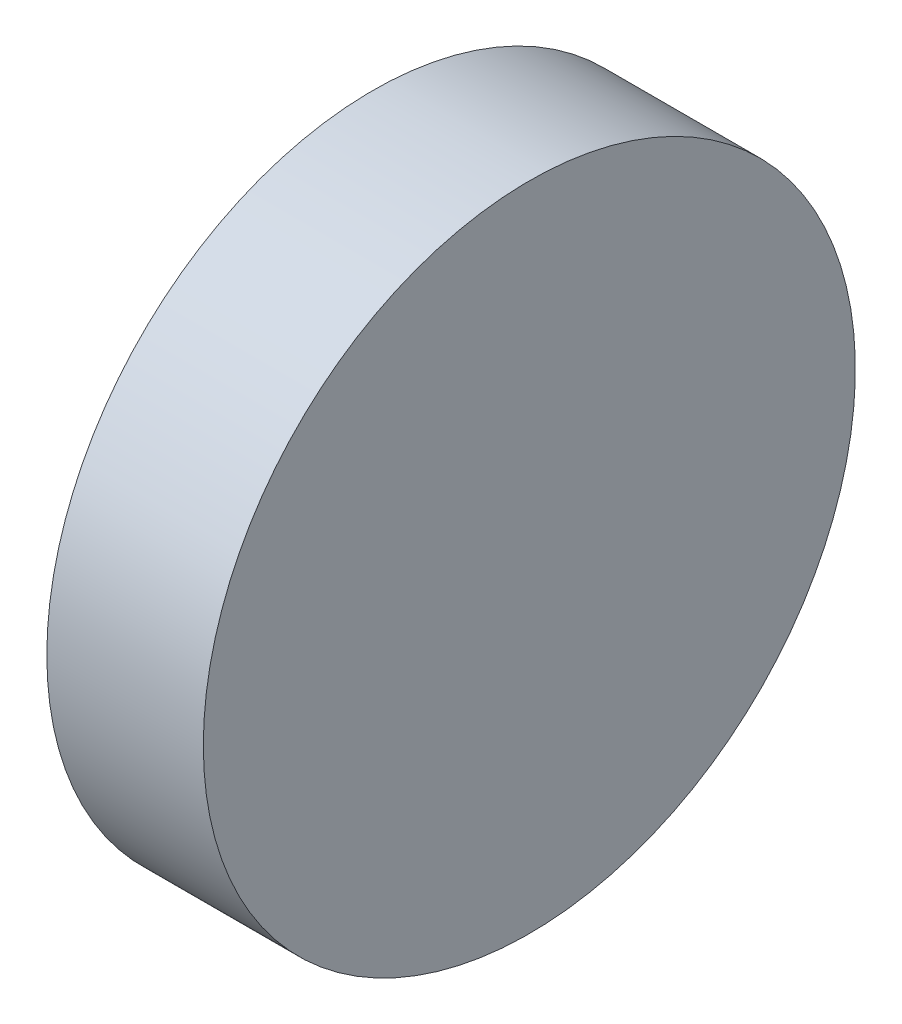
ISO-10303-21;
HEADER;
FILE_DESCRIPTION(('STEP AP214'),'2;1');
FILE_NAME('part.step','',(''),(''),'','','');
FILE_SCHEMA(('AUTOMOTIVE_DESIGN { 1 0 10303 214 1 1 1 1 }'));
ENDSEC;
DATA;
#1=APPLICATION_CONTEXT('core data for automotive mechanical design processes');
#2=APPLICATION_PROTOCOL_DEFINITION('international standard','automotive_design',2000,#1);
#3=PRODUCT_CONTEXT('',#1,'mechanical');
#4=PRODUCT('Part','Part','',(#3));
#5=PRODUCT_RELATED_PRODUCT_CATEGORY('part','',(#4));
#6=PRODUCT_DEFINITION_FORMATION('','',#4);
#7=PRODUCT_DEFINITION_CONTEXT('part definition',#1,'design');
#8=PRODUCT_DEFINITION('design','',#6,#7);
#9=PRODUCT_DEFINITION_SHAPE('','',#8);
#10=(LENGTH_UNIT() NAMED_UNIT(*) SI_UNIT(.MILLI.,.METRE.));
#11=(NAMED_UNIT(*) PLANE_ANGLE_UNIT() SI_UNIT($,.RADIAN.));
#12=(NAMED_UNIT(*) SI_UNIT($,.STERADIAN.) SOLID_ANGLE_UNIT());
#13=UNCERTAINTY_MEASURE_WITH_UNIT(LENGTH_MEASURE(1.E-05),#10,'distance_accuracy_value','');
#14=(GEOMETRIC_REPRESENTATION_CONTEXT(3) GLOBAL_UNCERTAINTY_ASSIGNED_CONTEXT((#13)) GLOBAL_UNIT_ASSIGNED_CONTEXT((#10,
#11,#12)) REPRESENTATION_CONTEXT('',''));
#15=CARTESIAN_POINT('',(0.,0.,0.));
#16=DIRECTION('',(0.,0.,1.));
#17=DIRECTION('',(1.,0.,0.));
#18=AXIS2_PLACEMENT_3D('',#15,#16,#17);
#19=CARTESIAN_POINT('',(266.157140492561,77.2931793490154,0.));
#20=DIRECTION('',(-1.,0.,0.));
#21=DIRECTION('',(0.,0.,1.));
#22=AXIS2_PLACEMENT_3D('',#19,#20,#21);
#23=PLANE('',#22);
#24=CARTESIAN_POINT('',(266.157140492561,77.2931793490154,0.));
#25=DIRECTION('',(-1.,0.,0.));
#26=DIRECTION('',(0.,0.,1.));
#27=AXIS2_PLACEMENT_3D('',#24,#25,#26);
#28=CIRCLE('',#27,12.5);
#29=CARTESIAN_POINT('',(266.157140492561,77.2931793490154,12.5));
#30=VERTEX_POINT('',#29);
#31=EDGE_CURVE('E10',#30,#30,#28,.T.);
#32=ORIENTED_EDGE('',*,*,#31,.F.);
#33=EDGE_LOOP('',(#32));
#34=FACE_BOUND('',#33,.T.);
#35=ADVANCED_FACE('F35',(#34),#23,.F.);
#36=CARTESIAN_POINT('',(254.000801992616,77.2931793490154,0.));
#37=DIRECTION('',(-1.,0.,0.));
#38=DIRECTION('',(0.,0.,1.));
#39=AXIS2_PLACEMENT_3D('',#36,#37,#38);
#40=CYLINDRICAL_SURFACE('',#39,12.5);
#41=CARTESIAN_POINT('',(260.157140492561,77.2931793490154,0.));
#42=DIRECTION('',(-1.,0.,0.));
#43=DIRECTION('',(0.,0.,1.));
#44=AXIS2_PLACEMENT_3D('',#41,#42,#43);
#45=CIRCLE('',#44,12.5);
#46=CARTESIAN_POINT('',(260.157140492561,77.2931793490154,12.5));
#47=VERTEX_POINT('',#46);
#48=EDGE_CURVE('E41',#47,#47,#45,.T.);
#49=ORIENTED_EDGE('',*,*,#48,.F.);
#50=EDGE_LOOP('',(#49));
#51=FACE_BOUND('',#50,.T.);
#52=ORIENTED_EDGE('',*,*,#31,.T.);
#53=EDGE_LOOP('',(#52));
#54=FACE_BOUND('',#53,.T.);
#55=ADVANCED_FACE('F49',(#51,#54),#40,.T.);
#56=CARTESIAN_POINT('',(260.157140492561,77.2931793490154,0.));
#57=DIRECTION('',(1.,0.,0.));
#58=DIRECTION('',(0.,0.,-1.));
#59=AXIS2_PLACEMENT_3D('',#56,#57,#58);
#60=PLANE('',#59);
#61=ORIENTED_EDGE('',*,*,#48,.T.);
#62=EDGE_LOOP('',(#61));
#63=FACE_BOUND('',#62,.T.);
#64=ADVANCED_FACE('F47',(#63),#60,.F.);
#65=CLOSED_SHELL('',(#35,#55,#64));
#66=MANIFOLD_SOLID_BREP('B2',#65);
#67=ADVANCED_BREP_SHAPE_REPRESENTATION('',(#18,#66),#14);
#68=SHAPE_DEFINITION_REPRESENTATION(#9,#67);
ENDSEC;
END-ISO-10303-21;
